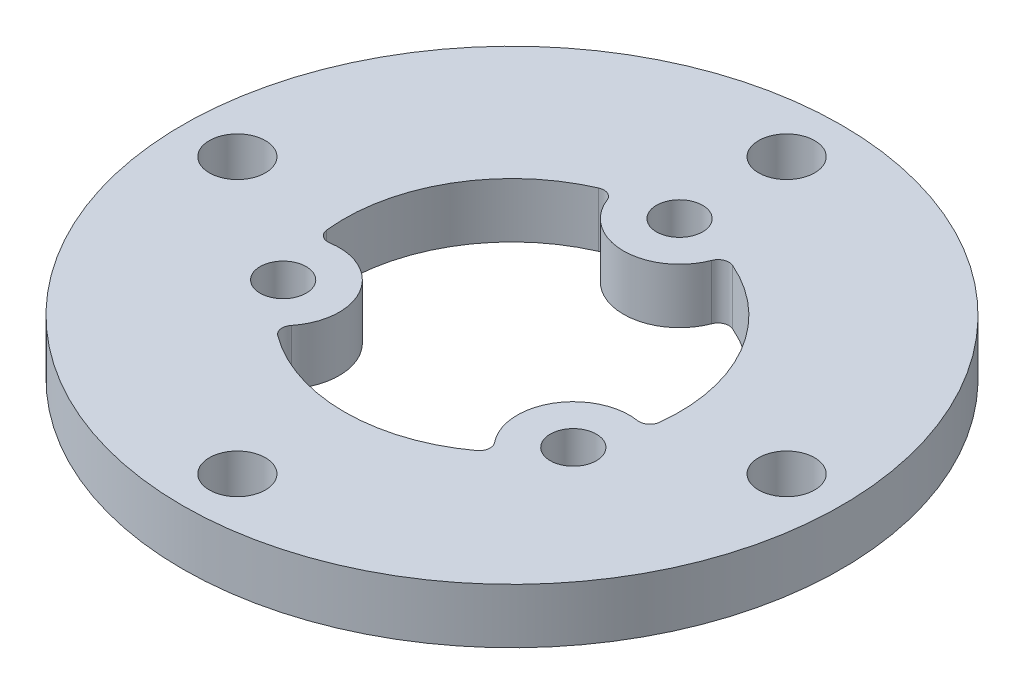
ISO-10303-21;
HEADER;
FILE_DESCRIPTION(('STEP AP214'),'2;1');
FILE_NAME('part.step','',(''),(''),'','','');
FILE_SCHEMA(('AUTOMOTIVE_DESIGN { 1 0 10303 214 1 1 1 1 }'));
ENDSEC;
DATA;
#1=APPLICATION_CONTEXT('core data for automotive mechanical design processes');
#2=APPLICATION_PROTOCOL_DEFINITION('international standard','automotive_design',2000,#1);
#3=PRODUCT_CONTEXT('',#1,'mechanical');
#4=PRODUCT('Part','Part','',(#3));
#5=PRODUCT_RELATED_PRODUCT_CATEGORY('part','',(#4));
#6=PRODUCT_DEFINITION_FORMATION('','',#4);
#7=PRODUCT_DEFINITION_CONTEXT('part definition',#1,'design');
#8=PRODUCT_DEFINITION('design','',#6,#7);
#9=PRODUCT_DEFINITION_SHAPE('','',#8);
#10=(LENGTH_UNIT() NAMED_UNIT(*) SI_UNIT(.MILLI.,.METRE.));
#11=(NAMED_UNIT(*) PLANE_ANGLE_UNIT() SI_UNIT($,.RADIAN.));
#12=(NAMED_UNIT(*) SI_UNIT($,.STERADIAN.) SOLID_ANGLE_UNIT());
#13=UNCERTAINTY_MEASURE_WITH_UNIT(LENGTH_MEASURE(1.E-05),#10,'distance_accuracy_value','');
#14=(GEOMETRIC_REPRESENTATION_CONTEXT(3) GLOBAL_UNCERTAINTY_ASSIGNED_CONTEXT((#13)) GLOBAL_UNIT_ASSIGNED_CONTEXT((#10,
#11,#12)) REPRESENTATION_CONTEXT('',''));
#15=CARTESIAN_POINT('',(0.,0.,0.));
#16=DIRECTION('',(0.,0.,1.));
#17=DIRECTION('',(1.,0.,0.));
#18=AXIS2_PLACEMENT_3D('',#15,#16,#17);
#19=CARTESIAN_POINT('',(0.,5.,0.));
#20=DIRECTION('',(0.,1.,0.));
#21=DIRECTION('',(0.,0.,1.));
#22=AXIS2_PLACEMENT_3D('',#19,#20,#21);
#23=PLANE('',#22);
#24=CARTESIAN_POINT('',(-25.,5.,0.));
#25=DIRECTION('',(0.,1.,0.));
#26=DIRECTION('',(0.,0.,1.));
#27=AXIS2_PLACEMENT_3D('',#24,#25,#26);
#28=CIRCLE('',#27,2.55);
#29=CARTESIAN_POINT('',(-25.,5.,2.55));
#30=VERTEX_POINT('',#29);
#31=EDGE_CURVE('E158',#30,#30,#28,.T.);
#32=ORIENTED_EDGE('',*,*,#31,.F.);
#33=EDGE_LOOP('',(#32));
#34=FACE_BOUND('',#33,.T.);
#35=CARTESIAN_POINT('',(25.,5.,0.));
#36=DIRECTION('',(0.,1.,0.));
#37=DIRECTION('',(0.,0.,1.));
#38=AXIS2_PLACEMENT_3D('',#35,#36,#37);
#39=CIRCLE('',#38,2.55);
#40=CARTESIAN_POINT('',(25.,5.,2.55));
#41=VERTEX_POINT('',#40);
#42=EDGE_CURVE('E172',#41,#41,#39,.T.);
#43=ORIENTED_EDGE('',*,*,#42,.F.);
#44=EDGE_LOOP('',(#43));
#45=FACE_BOUND('',#44,.T.);
#46=CARTESIAN_POINT('',(13.2068874077127,5.,7.625));
#47=DIRECTION('',(0.,1.,0.));
#48=DIRECTION('',(0.,0.,1.));
#49=AXIS2_PLACEMENT_3D('',#46,#47,#48);
#50=CIRCLE('',#49,2.1);
#51=CARTESIAN_POINT('',(13.2068874077127,5.,9.725));
#52=VERTEX_POINT('',#51);
#53=EDGE_CURVE('E184',#52,#52,#50,.T.);
#54=ORIENTED_EDGE('',*,*,#53,.F.);
#55=EDGE_LOOP('',(#54));
#56=FACE_BOUND('',#55,.T.);
#57=CARTESIAN_POINT('',(0.,5.,-15.25));
#58=DIRECTION('',(0.,1.,0.));
#59=DIRECTION('',(0.,0.,1.));
#60=AXIS2_PLACEMENT_3D('',#57,#58,#59);
#61=CIRCLE('',#60,2.1);
#62=CARTESIAN_POINT('',(0.,5.,-13.15));
#63=VERTEX_POINT('',#62);
#64=EDGE_CURVE('E196',#63,#63,#61,.T.);
#65=ORIENTED_EDGE('',*,*,#64,.F.);
#66=EDGE_LOOP('',(#65));
#67=FACE_BOUND('',#66,.T.);
#68=CARTESIAN_POINT('',(0.,5.,0.));
#69=DIRECTION('',(0.,1.,0.));
#70=DIRECTION('',(0.,0.,1.));
#71=AXIS2_PLACEMENT_3D('',#68,#69,#70);
#72=CIRCLE('',#71,30.);
#73=CARTESIAN_POINT('',(0.,5.,30.));
#74=VERTEX_POINT('',#73);
#75=EDGE_CURVE('E202',#74,#74,#72,.T.);
#76=ORIENTED_EDGE('',*,*,#75,.T.);
#77=EDGE_LOOP('',(#76));
#78=FACE_BOUND('',#77,.T.);
#79=CARTESIAN_POINT('',(0.,5.,-25.));
#80=DIRECTION('',(0.,1.,0.));
#81=DIRECTION('',(0.,0.,1.));
#82=AXIS2_PLACEMENT_3D('',#79,#80,#81);
#83=CIRCLE('',#82,2.55);
#84=CARTESIAN_POINT('',(0.,5.,-22.45));
#85=VERTEX_POINT('',#84);
#86=EDGE_CURVE('E190',#85,#85,#83,.T.);
#87=ORIENTED_EDGE('',*,*,#86,.F.);
#88=EDGE_LOOP('',(#87));
#89=FACE_BOUND('',#88,.T.);
#90=CARTESIAN_POINT('',(-13.2068874077127,5.,7.62500000000001));
#91=DIRECTION('',(0.,1.,0.));
#92=DIRECTION('',(0.,0.,1.));
#93=AXIS2_PLACEMENT_3D('',#90,#91,#92);
#94=CIRCLE('',#93,2.1);
#95=CARTESIAN_POINT('',(-13.2068874077127,5.,9.72500000000001));
#96=VERTEX_POINT('',#95);
#97=EDGE_CURVE('E178',#96,#96,#94,.T.);
#98=ORIENTED_EDGE('',*,*,#97,.F.);
#99=EDGE_LOOP('',(#98));
#100=FACE_BOUND('',#99,.T.);
#101=CARTESIAN_POINT('',(0.,5.,25.));
#102=DIRECTION('',(0.,1.,0.));
#103=DIRECTION('',(0.,0.,1.));
#104=AXIS2_PLACEMENT_3D('',#101,#102,#103);
#105=CIRCLE('',#104,2.55);
#106=CARTESIAN_POINT('',(0.,5.,27.55));
#107=VERTEX_POINT('',#106);
#108=EDGE_CURVE('E166',#107,#107,#105,.T.);
#109=ORIENTED_EDGE('',*,*,#108,.F.);
#110=EDGE_LOOP('',(#109));
#111=FACE_BOUND('',#110,.T.);
#112=CARTESIAN_POINT('',(0.,5.,0.));
#113=DIRECTION('',(0.,1.,0.));
#114=DIRECTION('',(0.,0.,1.));
#115=AXIS2_PLACEMENT_3D('',#112,#113,#114);
#116=CIRCLE('',#115,15.25);
#117=CARTESIAN_POINT('',(-6.09399831904025,5.,-13.9794736842105));
#118=VERTEX_POINT('',#117);
#119=CARTESIAN_POINT('',(-15.1535785015825,5.,1.71217948719675));
#120=VERTEX_POINT('',#119);
#121=EDGE_CURVE('E244',#118,#120,#116,.T.);
#122=ORIENTED_EDGE('',*,*,#121,.F.);
#123=CARTESIAN_POINT('',(-5.69439187189007,5.,-13.0627868852459));
#124=DIRECTION('',(0.,1.,0.));
#125=DIRECTION('',(0.,0.,1.));
#126=AXIS2_PLACEMENT_3D('',#123,#124,#125);
#127=CIRCLE('',#126,1.);
#128=CARTESIAN_POINT('',(-4.7608850076458,5.,-13.4213464122548));
#129=VERTEX_POINT('',#128);
#130=EDGE_CURVE('E41',#118,#129,#127,.F.);
#131=ORIENTED_EDGE('',*,*,#130,.T.);
#132=CARTESIAN_POINT('',(0.,5.,-15.25));
#133=DIRECTION('',(0.,-1.,0.));
#134=DIRECTION('',(0.,0.,1.));
#135=AXIS2_PLACEMENT_3D('',#132,#133,#134);
#136=CIRCLE('',#135,5.1);
#137=CARTESIAN_POINT('',(4.7608850076458,5.,-13.4213464122548));
#138=VERTEX_POINT('',#137);
#139=EDGE_CURVE('E149',#138,#129,#136,.T.);
#140=ORIENTED_EDGE('',*,*,#139,.F.);
#141=CARTESIAN_POINT('',(5.69439187189007,5.,-13.0627868852459));
#142=DIRECTION('',(0.,1.,0.));
#143=DIRECTION('',(0.,0.,1.));
#144=AXIS2_PLACEMENT_3D('',#141,#142,#143);
#145=CIRCLE('',#144,1.);
#146=CARTESIAN_POINT('',(6.09399831904025,5.,-13.9794736842105));
#147=VERTEX_POINT('',#146);
#148=EDGE_CURVE('E148',#138,#147,#145,.F.);
#149=ORIENTED_EDGE('',*,*,#148,.T.);
#150=CARTESIAN_POINT('',(0.,5.,0.));
#151=DIRECTION('',(0.,1.,0.));
#152=DIRECTION('',(0.,0.,1.));
#153=AXIS2_PLACEMENT_3D('',#150,#151,#152);
#154=CIRCLE('',#153,15.25);
#155=CARTESIAN_POINT('',(15.1535785015825,5.,1.71217948719674));
#156=VERTEX_POINT('',#155);
#157=EDGE_CURVE('E140',#156,#147,#154,.T.);
#158=ORIENTED_EDGE('',*,*,#157,.F.);
#159=CARTESIAN_POINT('',(14.1599012227902,5.,1.59990542246253));
#160=DIRECTION('',(0.,1.,0.));
#161=DIRECTION('',(0.,0.,1.));
#162=AXIS2_PLACEMENT_3D('',#159,#160,#161);
#163=CIRCLE('',#162,1.);
#164=CARTESIAN_POINT('',(14.0036694498267,5.,2.58762584500965));
#165=VERTEX_POINT('',#164);
#166=EDGE_CURVE('E123',#156,#165,#163,.F.);
#167=ORIENTED_EDGE('',*,*,#166,.T.);
#168=CARTESIAN_POINT('',(13.2068874077127,5.,7.625));
#169=DIRECTION('',(0.,-1.,0.));
#170=DIRECTION('',(0.,0.,1.));
#171=AXIS2_PLACEMENT_3D('',#168,#169,#170);
#172=CIRCLE('',#171,5.1);
#173=CARTESIAN_POINT('',(9.24278444218087,5.,10.8337205672451));
#174=VERTEX_POINT('',#173);
#175=EDGE_CURVE('E150',#174,#165,#172,.T.);
#176=ORIENTED_EDGE('',*,*,#175,.F.);
#177=CARTESIAN_POINT('',(8.46550935090012,5.,11.4628814627834));
#178=DIRECTION('',(0.,1.,0.));
#179=DIRECTION('',(0.,0.,1.));
#180=AXIS2_PLACEMENT_3D('',#177,#178,#179);
#181=CIRCLE('',#180,1.);
#182=CARTESIAN_POINT('',(9.05958018254224,5.,12.2672941970138));
#183=VERTEX_POINT('',#182);
#184=EDGE_CURVE('E230',#174,#183,#181,.F.);
#185=ORIENTED_EDGE('',*,*,#184,.T.);
#186=CARTESIAN_POINT('',(0.,5.,0.));
#187=DIRECTION('',(0.,1.,0.));
#188=DIRECTION('',(0.,0.,1.));
#189=AXIS2_PLACEMENT_3D('',#186,#187,#188);
#190=CIRCLE('',#189,15.25);
#191=CARTESIAN_POINT('',(-9.05958018254223,5.,12.2672941970138));
#192=VERTEX_POINT('',#191);
#193=EDGE_CURVE('E154',#192,#183,#190,.T.);
#194=ORIENTED_EDGE('',*,*,#193,.F.);
#195=CARTESIAN_POINT('',(-8.46550935090011,5.,11.4628814627834));
#196=DIRECTION('',(0.,1.,0.));
#197=DIRECTION('',(0.,0.,1.));
#198=AXIS2_PLACEMENT_3D('',#195,#196,#197);
#199=CIRCLE('',#198,1.);
#200=CARTESIAN_POINT('',(-9.24278444218086,5.,10.8337205672451));
#201=VERTEX_POINT('',#200);
#202=EDGE_CURVE('E234',#192,#201,#199,.F.);
#203=ORIENTED_EDGE('',*,*,#202,.T.);
#204=CARTESIAN_POINT('',(-13.2068874077127,5.,7.62500000000001));
#205=DIRECTION('',(0.,-1.,0.));
#206=DIRECTION('',(0.,0.,1.));
#207=AXIS2_PLACEMENT_3D('',#204,#205,#206);
#208=CIRCLE('',#207,5.1);
#209=CARTESIAN_POINT('',(-14.0036694498267,5.,2.58762584500966));
#210=VERTEX_POINT('',#209);
#211=EDGE_CURVE('E271',#210,#201,#208,.T.);
#212=ORIENTED_EDGE('',*,*,#211,.F.);
#213=CARTESIAN_POINT('',(-14.1599012227902,5.,1.59990542246254));
#214=DIRECTION('',(0.,1.,0.));
#215=DIRECTION('',(0.,0.,1.));
#216=AXIS2_PLACEMENT_3D('',#213,#214,#215);
#217=CIRCLE('',#216,1.);
#218=EDGE_CURVE('E238',#210,#120,#217,.F.);
#219=ORIENTED_EDGE('',*,*,#218,.T.);
#220=EDGE_LOOP('',(#122,#131,#140,#149,#158,#167,#176,#185,#194,#203,#212,#219));
#221=FACE_BOUND('',#220,.T.);
#222=ADVANCED_FACE('F33',(#34,#45,#56,#67,#78,#89,#100,#111,#221),#23,.T.);
#223=CARTESIAN_POINT('',(0.,0.,0.));
#224=DIRECTION('',(0.,1.,0.));
#225=DIRECTION('',(0.,0.,1.));
#226=AXIS2_PLACEMENT_3D('',#223,#224,#225);
#227=PLANE('',#226);
#228=CARTESIAN_POINT('',(-25.,0.,0.));
#229=DIRECTION('',(0.,1.,0.));
#230=DIRECTION('',(0.,0.,1.));
#231=AXIS2_PLACEMENT_3D('',#228,#229,#230);
#232=CIRCLE('',#231,2.55);
#233=CARTESIAN_POINT('',(-25.,0.,2.55));
#234=VERTEX_POINT('',#233);
#235=EDGE_CURVE('E162',#234,#234,#232,.T.);
#236=ORIENTED_EDGE('',*,*,#235,.T.);
#237=EDGE_LOOP('',(#236));
#238=FACE_BOUND('',#237,.T.);
#239=CARTESIAN_POINT('',(0.,0.,25.));
#240=DIRECTION('',(0.,1.,0.));
#241=DIRECTION('',(0.,0.,1.));
#242=AXIS2_PLACEMENT_3D('',#239,#240,#241);
#243=CIRCLE('',#242,2.55);
#244=CARTESIAN_POINT('',(0.,0.,27.55));
#245=VERTEX_POINT('',#244);
#246=EDGE_CURVE('E161',#245,#245,#243,.T.);
#247=ORIENTED_EDGE('',*,*,#246,.T.);
#248=EDGE_LOOP('',(#247));
#249=FACE_BOUND('',#248,.T.);
#250=CARTESIAN_POINT('',(25.,0.,0.));
#251=DIRECTION('',(0.,1.,0.));
#252=DIRECTION('',(0.,0.,1.));
#253=AXIS2_PLACEMENT_3D('',#250,#251,#252);
#254=CIRCLE('',#253,2.55);
#255=CARTESIAN_POINT('',(25.,0.,2.55));
#256=VERTEX_POINT('',#255);
#257=EDGE_CURVE('E169',#256,#256,#254,.T.);
#258=ORIENTED_EDGE('',*,*,#257,.T.);
#259=EDGE_LOOP('',(#258));
#260=FACE_BOUND('',#259,.T.);
#261=CARTESIAN_POINT('',(-13.2068874077127,0.,7.62500000000001));
#262=DIRECTION('',(0.,1.,0.));
#263=DIRECTION('',(0.,0.,1.));
#264=AXIS2_PLACEMENT_3D('',#261,#262,#263);
#265=CIRCLE('',#264,2.1);
#266=CARTESIAN_POINT('',(-13.2068874077127,0.,9.72500000000001));
#267=VERTEX_POINT('',#266);
#268=EDGE_CURVE('E175',#267,#267,#265,.T.);
#269=ORIENTED_EDGE('',*,*,#268,.T.);
#270=EDGE_LOOP('',(#269));
#271=FACE_BOUND('',#270,.T.);
#272=CARTESIAN_POINT('',(13.2068874077127,0.,7.625));
#273=DIRECTION('',(0.,1.,0.));
#274=DIRECTION('',(0.,0.,1.));
#275=AXIS2_PLACEMENT_3D('',#272,#273,#274);
#276=CIRCLE('',#275,2.1);
#277=CARTESIAN_POINT('',(13.2068874077127,0.,9.725));
#278=VERTEX_POINT('',#277);
#279=EDGE_CURVE('E181',#278,#278,#276,.T.);
#280=ORIENTED_EDGE('',*,*,#279,.T.);
#281=EDGE_LOOP('',(#280));
#282=FACE_BOUND('',#281,.T.);
#283=CARTESIAN_POINT('',(0.,0.,-25.));
#284=DIRECTION('',(0.,1.,0.));
#285=DIRECTION('',(0.,0.,1.));
#286=AXIS2_PLACEMENT_3D('',#283,#284,#285);
#287=CIRCLE('',#286,2.55);
#288=CARTESIAN_POINT('',(0.,0.,-22.45));
#289=VERTEX_POINT('',#288);
#290=EDGE_CURVE('E187',#289,#289,#287,.T.);
#291=ORIENTED_EDGE('',*,*,#290,.T.);
#292=EDGE_LOOP('',(#291));
#293=FACE_BOUND('',#292,.T.);
#294=CARTESIAN_POINT('',(0.,0.,-15.25));
#295=DIRECTION('',(0.,1.,0.));
#296=DIRECTION('',(0.,0.,1.));
#297=AXIS2_PLACEMENT_3D('',#294,#295,#296);
#298=CIRCLE('',#297,2.1);
#299=CARTESIAN_POINT('',(0.,0.,-13.15));
#300=VERTEX_POINT('',#299);
#301=EDGE_CURVE('E193',#300,#300,#298,.T.);
#302=ORIENTED_EDGE('',*,*,#301,.T.);
#303=EDGE_LOOP('',(#302));
#304=FACE_BOUND('',#303,.T.);
#305=CARTESIAN_POINT('',(0.,0.,0.));
#306=DIRECTION('',(0.,1.,0.));
#307=DIRECTION('',(0.,0.,1.));
#308=AXIS2_PLACEMENT_3D('',#305,#306,#307);
#309=CIRCLE('',#308,30.);
#310=CARTESIAN_POINT('',(0.,0.,30.));
#311=VERTEX_POINT('',#310);
#312=EDGE_CURVE('E199',#311,#311,#309,.T.);
#313=ORIENTED_EDGE('',*,*,#312,.F.);
#314=EDGE_LOOP('',(#313));
#315=FACE_BOUND('',#314,.T.);
#316=CARTESIAN_POINT('',(0.,0.,0.));
#317=DIRECTION('',(0.,1.,0.));
#318=DIRECTION('',(0.,0.,1.));
#319=AXIS2_PLACEMENT_3D('',#316,#317,#318);
#320=CIRCLE('',#319,15.25);
#321=CARTESIAN_POINT('',(15.1535785015825,0.,1.71217948719674));
#322=VERTEX_POINT('',#321);
#323=CARTESIAN_POINT('',(6.09399831904025,0.,-13.9794736842105));
#324=VERTEX_POINT('',#323);
#325=EDGE_CURVE('E142',#322,#324,#320,.T.);
#326=ORIENTED_EDGE('',*,*,#325,.T.);
#327=CARTESIAN_POINT('',(5.69439187189007,0.,-13.0627868852459));
#328=DIRECTION('',(0.,1.,0.));
#329=DIRECTION('',(0.,0.,1.));
#330=AXIS2_PLACEMENT_3D('',#327,#328,#329);
#331=CIRCLE('',#330,1.);
#332=CARTESIAN_POINT('',(4.7608850076458,0.,-13.4213464122548));
#333=VERTEX_POINT('',#332);
#334=EDGE_CURVE('E55',#324,#333,#331,.T.);
#335=ORIENTED_EDGE('',*,*,#334,.T.);
#336=CARTESIAN_POINT('',(0.,0.,-15.25));
#337=DIRECTION('',(0.,-1.,0.));
#338=DIRECTION('',(0.,0.,1.));
#339=AXIS2_PLACEMENT_3D('',#336,#337,#338);
#340=CIRCLE('',#339,5.1);
#341=CARTESIAN_POINT('',(-4.7608850076458,0.,-13.4213464122548));
#342=VERTEX_POINT('',#341);
#343=EDGE_CURVE('E165',#333,#342,#340,.T.);
#344=ORIENTED_EDGE('',*,*,#343,.T.);
#345=CARTESIAN_POINT('',(-5.69439187189007,0.,-13.0627868852459));
#346=DIRECTION('',(0.,1.,0.));
#347=DIRECTION('',(0.,0.,1.));
#348=AXIS2_PLACEMENT_3D('',#345,#346,#347);
#349=CIRCLE('',#348,1.);
#350=CARTESIAN_POINT('',(-6.09399831904025,0.,-13.9794736842105));
#351=VERTEX_POINT('',#350);
#352=EDGE_CURVE('E11',#342,#351,#349,.T.);
#353=ORIENTED_EDGE('',*,*,#352,.T.);
#354=CARTESIAN_POINT('',(0.,0.,0.));
#355=DIRECTION('',(0.,1.,0.));
#356=DIRECTION('',(0.,0.,1.));
#357=AXIS2_PLACEMENT_3D('',#354,#355,#356);
#358=CIRCLE('',#357,15.25);
#359=CARTESIAN_POINT('',(-15.1535785015825,0.,1.71217948719675));
#360=VERTEX_POINT('',#359);
#361=EDGE_CURVE('E152',#351,#360,#358,.T.);
#362=ORIENTED_EDGE('',*,*,#361,.T.);
#363=CARTESIAN_POINT('',(-14.1599012227902,0.,1.59990542246254));
#364=DIRECTION('',(0.,1.,0.));
#365=DIRECTION('',(0.,0.,1.));
#366=AXIS2_PLACEMENT_3D('',#363,#364,#365);
#367=CIRCLE('',#366,1.);
#368=CARTESIAN_POINT('',(-14.0036694498267,0.,2.58762584500966));
#369=VERTEX_POINT('',#368);
#370=EDGE_CURVE('E240',#360,#369,#367,.T.);
#371=ORIENTED_EDGE('',*,*,#370,.T.);
#372=CARTESIAN_POINT('',(-13.2068874077127,0.,7.62500000000001));
#373=DIRECTION('',(0.,-1.,0.));
#374=DIRECTION('',(0.,0.,1.));
#375=AXIS2_PLACEMENT_3D('',#372,#373,#374);
#376=CIRCLE('',#375,5.1);
#377=CARTESIAN_POINT('',(-9.24278444218086,0.,10.8337205672451));
#378=VERTEX_POINT('',#377);
#379=EDGE_CURVE('E257',#369,#378,#376,.T.);
#380=ORIENTED_EDGE('',*,*,#379,.T.);
#381=CARTESIAN_POINT('',(-8.46550935090011,0.,11.4628814627834));
#382=DIRECTION('',(0.,1.,0.));
#383=DIRECTION('',(0.,0.,1.));
#384=AXIS2_PLACEMENT_3D('',#381,#382,#383);
#385=CIRCLE('',#384,1.);
#386=CARTESIAN_POINT('',(-9.05958018254223,0.,12.2672941970138));
#387=VERTEX_POINT('',#386);
#388=EDGE_CURVE('E236',#378,#387,#385,.T.);
#389=ORIENTED_EDGE('',*,*,#388,.T.);
#390=CARTESIAN_POINT('',(0.,0.,0.));
#391=DIRECTION('',(0.,1.,0.));
#392=DIRECTION('',(0.,0.,1.));
#393=AXIS2_PLACEMENT_3D('',#390,#391,#392);
#394=CIRCLE('',#393,15.25);
#395=CARTESIAN_POINT('',(9.05958018254224,0.,12.2672941970138));
#396=VERTEX_POINT('',#395);
#397=EDGE_CURVE('E260',#387,#396,#394,.T.);
#398=ORIENTED_EDGE('',*,*,#397,.T.);
#399=CARTESIAN_POINT('',(8.46550935090012,0.,11.4628814627834));
#400=DIRECTION('',(0.,1.,0.));
#401=DIRECTION('',(0.,0.,1.));
#402=AXIS2_PLACEMENT_3D('',#399,#400,#401);
#403=CIRCLE('',#402,1.);
#404=CARTESIAN_POINT('',(9.24278444218087,0.,10.8337205672451));
#405=VERTEX_POINT('',#404);
#406=EDGE_CURVE('E232',#396,#405,#403,.T.);
#407=ORIENTED_EDGE('',*,*,#406,.T.);
#408=CARTESIAN_POINT('',(13.2068874077127,0.,7.625));
#409=DIRECTION('',(0.,-1.,0.));
#410=DIRECTION('',(0.,0.,1.));
#411=AXIS2_PLACEMENT_3D('',#408,#409,#410);
#412=CIRCLE('',#411,5.1);
#413=CARTESIAN_POINT('',(14.0036694498267,0.,2.58762584500965));
#414=VERTEX_POINT('',#413);
#415=EDGE_CURVE('E265',#405,#414,#412,.T.);
#416=ORIENTED_EDGE('',*,*,#415,.T.);
#417=CARTESIAN_POINT('',(14.1599012227902,0.,1.59990542246253));
#418=DIRECTION('',(0.,1.,0.));
#419=DIRECTION('',(0.,0.,1.));
#420=AXIS2_PLACEMENT_3D('',#417,#418,#419);
#421=CIRCLE('',#420,1.);
#422=EDGE_CURVE('E133',#414,#322,#421,.T.);
#423=ORIENTED_EDGE('',*,*,#422,.T.);
#424=EDGE_LOOP('',(#326,#335,#344,#353,#362,#371,#380,#389,#398,#407,#416,#423));
#425=FACE_BOUND('',#424,.T.);
#426=ADVANCED_FACE('F252',(#238,#249,#260,#271,#282,#293,#304,#315,#425),#227,.F.);
#427=CARTESIAN_POINT('',(0.,5.,0.));
#428=DIRECTION('',(0.,-1.,0.));
#429=DIRECTION('',(0.,0.,-1.));
#430=AXIS2_PLACEMENT_3D('',#427,#428,#429);
#431=CYLINDRICAL_SURFACE('',#430,30.);
#432=ORIENTED_EDGE('',*,*,#75,.F.);
#433=EDGE_LOOP('',(#432));
#434=FACE_BOUND('',#433,.T.);
#435=ORIENTED_EDGE('',*,*,#312,.T.);
#436=EDGE_LOOP('',(#435));
#437=FACE_BOUND('',#436,.T.);
#438=ADVANCED_FACE('F303',(#434,#437),#431,.T.);
#439=CARTESIAN_POINT('',(0.,5.,-15.25));
#440=DIRECTION('',(0.,-1.,0.));
#441=DIRECTION('',(0.,0.,-1.));
#442=AXIS2_PLACEMENT_3D('',#439,#440,#441);
#443=CYLINDRICAL_SURFACE('',#442,2.1);
#444=ORIENTED_EDGE('',*,*,#64,.T.);
#445=EDGE_LOOP('',(#444));
#446=FACE_BOUND('',#445,.T.);
#447=ORIENTED_EDGE('',*,*,#301,.F.);
#448=EDGE_LOOP('',(#447));
#449=FACE_BOUND('',#448,.T.);
#450=ADVANCED_FACE('F309',(#446,#449),#443,.F.);
#451=CARTESIAN_POINT('',(0.,5.,-25.));
#452=DIRECTION('',(0.,-1.,0.));
#453=DIRECTION('',(0.,0.,-1.));
#454=AXIS2_PLACEMENT_3D('',#451,#452,#453);
#455=CYLINDRICAL_SURFACE('',#454,2.55);
#456=ORIENTED_EDGE('',*,*,#86,.T.);
#457=EDGE_LOOP('',(#456));
#458=FACE_BOUND('',#457,.T.);
#459=ORIENTED_EDGE('',*,*,#290,.F.);
#460=EDGE_LOOP('',(#459));
#461=FACE_BOUND('',#460,.T.);
#462=ADVANCED_FACE('F450',(#458,#461),#455,.F.);
#463=CARTESIAN_POINT('',(13.2068874077127,5.,7.625));
#464=DIRECTION('',(0.,-1.,0.));
#465=DIRECTION('',(0.,0.,-1.));
#466=AXIS2_PLACEMENT_3D('',#463,#464,#465);
#467=CYLINDRICAL_SURFACE('',#466,2.1);
#468=ORIENTED_EDGE('',*,*,#53,.T.);
#469=EDGE_LOOP('',(#468));
#470=FACE_BOUND('',#469,.T.);
#471=ORIENTED_EDGE('',*,*,#279,.F.);
#472=EDGE_LOOP('',(#471));
#473=FACE_BOUND('',#472,.T.);
#474=ADVANCED_FACE('F442',(#470,#473),#467,.F.);
#475=CARTESIAN_POINT('',(-13.2068874077127,5.,7.62500000000001));
#476=DIRECTION('',(0.,-1.,0.));
#477=DIRECTION('',(0.,0.,-1.));
#478=AXIS2_PLACEMENT_3D('',#475,#476,#477);
#479=CYLINDRICAL_SURFACE('',#478,2.1);
#480=ORIENTED_EDGE('',*,*,#97,.T.);
#481=EDGE_LOOP('',(#480));
#482=FACE_BOUND('',#481,.T.);
#483=ORIENTED_EDGE('',*,*,#268,.F.);
#484=EDGE_LOOP('',(#483));
#485=FACE_BOUND('',#484,.T.);
#486=ADVANCED_FACE('F434',(#482,#485),#479,.F.);
#487=CARTESIAN_POINT('',(25.,5.,0.));
#488=DIRECTION('',(0.,-1.,0.));
#489=DIRECTION('',(0.,0.,-1.));
#490=AXIS2_PLACEMENT_3D('',#487,#488,#489);
#491=CYLINDRICAL_SURFACE('',#490,2.55);
#492=ORIENTED_EDGE('',*,*,#42,.T.);
#493=EDGE_LOOP('',(#492));
#494=FACE_BOUND('',#493,.T.);
#495=ORIENTED_EDGE('',*,*,#257,.F.);
#496=EDGE_LOOP('',(#495));
#497=FACE_BOUND('',#496,.T.);
#498=ADVANCED_FACE('F426',(#494,#497),#491,.F.);
#499=CARTESIAN_POINT('',(0.,5.,25.));
#500=DIRECTION('',(0.,-1.,0.));
#501=DIRECTION('',(0.,0.,-1.));
#502=AXIS2_PLACEMENT_3D('',#499,#500,#501);
#503=CYLINDRICAL_SURFACE('',#502,2.55);
#504=ORIENTED_EDGE('',*,*,#108,.T.);
#505=EDGE_LOOP('',(#504));
#506=FACE_BOUND('',#505,.T.);
#507=ORIENTED_EDGE('',*,*,#246,.F.);
#508=EDGE_LOOP('',(#507));
#509=FACE_BOUND('',#508,.T.);
#510=ADVANCED_FACE('F419',(#506,#509),#503,.F.);
#511=CARTESIAN_POINT('',(-25.,5.,0.));
#512=DIRECTION('',(0.,-1.,0.));
#513=DIRECTION('',(0.,0.,-1.));
#514=AXIS2_PLACEMENT_3D('',#511,#512,#513);
#515=CYLINDRICAL_SURFACE('',#514,2.55);
#516=ORIENTED_EDGE('',*,*,#31,.T.);
#517=EDGE_LOOP('',(#516));
#518=FACE_BOUND('',#517,.T.);
#519=ORIENTED_EDGE('',*,*,#235,.F.);
#520=EDGE_LOOP('',(#519));
#521=FACE_BOUND('',#520,.T.);
#522=ADVANCED_FACE('F402',(#518,#521),#515,.F.);
#523=CARTESIAN_POINT('',(0.,0.,0.));
#524=DIRECTION('',(0.,1.,0.));
#525=DIRECTION('',(0.,0.,1.));
#526=AXIS2_PLACEMENT_3D('',#523,#524,#525);
#527=CYLINDRICAL_SURFACE('',#526,15.25);
#528=ORIENTED_EDGE('',*,*,#121,.T.);
#529=DIRECTION('',(0.,1.,0.));
#530=VECTOR('',#529,1.);
#531=CARTESIAN_POINT('',(-15.1535785015825,0.,1.71217948719675));
#532=LINE('',#531,#530);
#533=EDGE_CURVE('E224',#120,#360,#532,.F.);
#534=ORIENTED_EDGE('',*,*,#533,.T.);
#535=ORIENTED_EDGE('',*,*,#361,.F.);
#536=DIRECTION('',(0.,1.,0.));
#537=VECTOR('',#536,1.);
#538=CARTESIAN_POINT('',(-6.09399831904025,0.,-13.9794736842105));
#539=LINE('',#538,#537);
#540=EDGE_CURVE('E221',#351,#118,#539,.T.);
#541=ORIENTED_EDGE('',*,*,#540,.T.);
#542=EDGE_LOOP('',(#528,#534,#535,#541));
#543=FACE_BOUND('',#542,.T.);
#544=ADVANCED_FACE('F255',(#543),#527,.F.);
#545=CARTESIAN_POINT('',(0.,0.,-15.25));
#546=DIRECTION('',(0.,1.,0.));
#547=DIRECTION('',(0.,0.,1.));
#548=AXIS2_PLACEMENT_3D('',#545,#546,#547);
#549=CYLINDRICAL_SURFACE('',#548,5.1);
#550=ORIENTED_EDGE('',*,*,#343,.F.);
#551=DIRECTION('',(0.,1.,0.));
#552=VECTOR('',#551,1.);
#553=CARTESIAN_POINT('',(4.7608850076458,0.,-13.4213464122548));
#554=LINE('',#553,#552);
#555=EDGE_CURVE('E134',#333,#138,#554,.T.);
#556=ORIENTED_EDGE('',*,*,#555,.T.);
#557=ORIENTED_EDGE('',*,*,#139,.T.);
#558=DIRECTION('',(0.,1.,0.));
#559=VECTOR('',#558,1.);
#560=CARTESIAN_POINT('',(-4.7608850076458,0.,-13.4213464122548));
#561=LINE('',#560,#559);
#562=EDGE_CURVE('E48',#129,#342,#561,.F.);
#563=ORIENTED_EDGE('',*,*,#562,.T.);
#564=EDGE_LOOP('',(#550,#556,#557,#563));
#565=FACE_BOUND('',#564,.T.);
#566=ADVANCED_FACE('F247',(#565),#549,.T.);
#567=CARTESIAN_POINT('',(0.,0.,0.));
#568=DIRECTION('',(0.,1.,0.));
#569=DIRECTION('',(0.,0.,1.));
#570=AXIS2_PLACEMENT_3D('',#567,#568,#569);
#571=CYLINDRICAL_SURFACE('',#570,15.25);
#572=ORIENTED_EDGE('',*,*,#325,.F.);
#573=DIRECTION('',(0.,1.,0.));
#574=VECTOR('',#573,1.);
#575=CARTESIAN_POINT('',(15.1535785015825,0.,1.71217948719674));
#576=LINE('',#575,#574);
#577=EDGE_CURVE('E127',#322,#156,#576,.T.);
#578=ORIENTED_EDGE('',*,*,#577,.T.);
#579=ORIENTED_EDGE('',*,*,#157,.T.);
#580=DIRECTION('',(0.,1.,0.));
#581=VECTOR('',#580,1.);
#582=CARTESIAN_POINT('',(6.09399831904025,0.,-13.9794736842105));
#583=LINE('',#582,#581);
#584=EDGE_CURVE('E144',#147,#324,#583,.F.);
#585=ORIENTED_EDGE('',*,*,#584,.T.);
#586=EDGE_LOOP('',(#572,#578,#579,#585));
#587=FACE_BOUND('',#586,.T.);
#588=ADVANCED_FACE('F139',(#587),#571,.F.);
#589=CARTESIAN_POINT('',(13.2068874077127,0.,7.625));
#590=DIRECTION('',(0.,1.,0.));
#591=DIRECTION('',(0.,0.,1.));
#592=AXIS2_PLACEMENT_3D('',#589,#590,#591);
#593=CYLINDRICAL_SURFACE('',#592,5.1);
#594=ORIENTED_EDGE('',*,*,#175,.T.);
#595=DIRECTION('',(0.,1.,0.));
#596=VECTOR('',#595,1.);
#597=CARTESIAN_POINT('',(14.0036694498267,0.,2.58762584500965));
#598=LINE('',#597,#596);
#599=EDGE_CURVE('E128',#165,#414,#598,.F.);
#600=ORIENTED_EDGE('',*,*,#599,.T.);
#601=ORIENTED_EDGE('',*,*,#415,.F.);
#602=DIRECTION('',(0.,1.,0.));
#603=VECTOR('',#602,1.);
#604=CARTESIAN_POINT('',(9.24278444218087,0.,10.8337205672451));
#605=LINE('',#604,#603);
#606=EDGE_CURVE('E143',#405,#174,#605,.T.);
#607=ORIENTED_EDGE('',*,*,#606,.T.);
#608=EDGE_LOOP('',(#594,#600,#601,#607));
#609=FACE_BOUND('',#608,.T.);
#610=ADVANCED_FACE('F286',(#609),#593,.T.);
#611=CARTESIAN_POINT('',(0.,0.,0.));
#612=DIRECTION('',(0.,1.,0.));
#613=DIRECTION('',(0.,0.,1.));
#614=AXIS2_PLACEMENT_3D('',#611,#612,#613);
#615=CYLINDRICAL_SURFACE('',#614,15.25);
#616=ORIENTED_EDGE('',*,*,#193,.T.);
#617=DIRECTION('',(0.,1.,0.));
#618=VECTOR('',#617,1.);
#619=CARTESIAN_POINT('',(9.05958018254224,0.,12.2672941970138));
#620=LINE('',#619,#618);
#621=EDGE_CURVE('E214',#183,#396,#620,.F.);
#622=ORIENTED_EDGE('',*,*,#621,.T.);
#623=ORIENTED_EDGE('',*,*,#397,.F.);
#624=DIRECTION('',(0.,1.,0.));
#625=VECTOR('',#624,1.);
#626=CARTESIAN_POINT('',(-9.05958018254223,0.,12.2672941970138));
#627=LINE('',#626,#625);
#628=EDGE_CURVE('E211',#387,#192,#627,.T.);
#629=ORIENTED_EDGE('',*,*,#628,.T.);
#630=EDGE_LOOP('',(#616,#622,#623,#629));
#631=FACE_BOUND('',#630,.T.);
#632=ADVANCED_FACE('F277',(#631),#615,.F.);
#633=CARTESIAN_POINT('',(-13.2068874077127,0.,7.62500000000001));
#634=DIRECTION('',(0.,1.,0.));
#635=DIRECTION('',(0.,0.,1.));
#636=AXIS2_PLACEMENT_3D('',#633,#634,#635);
#637=CYLINDRICAL_SURFACE('',#636,5.1);
#638=ORIENTED_EDGE('',*,*,#211,.T.);
#639=DIRECTION('',(0.,1.,0.));
#640=VECTOR('',#639,1.);
#641=CARTESIAN_POINT('',(-9.24278444218086,0.,10.8337205672451));
#642=LINE('',#641,#640);
#643=EDGE_CURVE('E219',#201,#378,#642,.F.);
#644=ORIENTED_EDGE('',*,*,#643,.T.);
#645=ORIENTED_EDGE('',*,*,#379,.F.);
#646=DIRECTION('',(0.,1.,0.));
#647=VECTOR('',#646,1.);
#648=CARTESIAN_POINT('',(-14.0036694498267,0.,2.58762584500966));
#649=LINE('',#648,#647);
#650=EDGE_CURVE('E216',#369,#210,#649,.T.);
#651=ORIENTED_EDGE('',*,*,#650,.T.);
#652=EDGE_LOOP('',(#638,#644,#645,#651));
#653=FACE_BOUND('',#652,.T.);
#654=ADVANCED_FACE('F293',(#653),#637,.T.);
#655=CARTESIAN_POINT('',(14.1599012227902,0.,1.59990542246253));
#656=DIRECTION('',(0.,1.,0.));
#657=DIRECTION('',(0.,0.,1.));
#658=AXIS2_PLACEMENT_3D('',#655,#656,#657);
#659=CYLINDRICAL_SURFACE('',#658,1.);
#660=ORIENTED_EDGE('',*,*,#422,.F.);
#661=ORIENTED_EDGE('',*,*,#599,.F.);
#662=ORIENTED_EDGE('',*,*,#166,.F.);
#663=ORIENTED_EDGE('',*,*,#577,.F.);
#664=EDGE_LOOP('',(#660,#661,#662,#663));
#665=FACE_BOUND('',#664,.T.);
#666=ADVANCED_FACE('F126',(#665),#659,.F.);
#667=CARTESIAN_POINT('',(8.46550935090012,0.,11.4628814627834));
#668=DIRECTION('',(0.,1.,0.));
#669=DIRECTION('',(0.,0.,1.));
#670=AXIS2_PLACEMENT_3D('',#667,#668,#669);
#671=CYLINDRICAL_SURFACE('',#670,1.);
#672=ORIENTED_EDGE('',*,*,#406,.F.);
#673=ORIENTED_EDGE('',*,*,#621,.F.);
#674=ORIENTED_EDGE('',*,*,#184,.F.);
#675=ORIENTED_EDGE('',*,*,#606,.F.);
#676=EDGE_LOOP('',(#672,#673,#674,#675));
#677=FACE_BOUND('',#676,.T.);
#678=ADVANCED_FACE('F282',(#677),#671,.F.);
#679=CARTESIAN_POINT('',(-8.46550935090011,0.,11.4628814627834));
#680=DIRECTION('',(0.,1.,0.));
#681=DIRECTION('',(0.,0.,1.));
#682=AXIS2_PLACEMENT_3D('',#679,#680,#681);
#683=CYLINDRICAL_SURFACE('',#682,1.);
#684=ORIENTED_EDGE('',*,*,#388,.F.);
#685=ORIENTED_EDGE('',*,*,#643,.F.);
#686=ORIENTED_EDGE('',*,*,#202,.F.);
#687=ORIENTED_EDGE('',*,*,#628,.F.);
#688=EDGE_LOOP('',(#684,#685,#686,#687));
#689=FACE_BOUND('',#688,.T.);
#690=ADVANCED_FACE('F319',(#689),#683,.F.);
#691=CARTESIAN_POINT('',(-14.1599012227902,0.,1.59990542246254));
#692=DIRECTION('',(0.,1.,0.));
#693=DIRECTION('',(0.,0.,1.));
#694=AXIS2_PLACEMENT_3D('',#691,#692,#693);
#695=CYLINDRICAL_SURFACE('',#694,1.);
#696=ORIENTED_EDGE('',*,*,#370,.F.);
#697=ORIENTED_EDGE('',*,*,#533,.F.);
#698=ORIENTED_EDGE('',*,*,#218,.F.);
#699=ORIENTED_EDGE('',*,*,#650,.F.);
#700=EDGE_LOOP('',(#696,#697,#698,#699));
#701=FACE_BOUND('',#700,.T.);
#702=ADVANCED_FACE('F322',(#701),#695,.F.);
#703=CARTESIAN_POINT('',(5.69439187189007,0.,-13.0627868852459));
#704=DIRECTION('',(0.,1.,0.));
#705=DIRECTION('',(0.,0.,1.));
#706=AXIS2_PLACEMENT_3D('',#703,#704,#705);
#707=CYLINDRICAL_SURFACE('',#706,1.);
#708=ORIENTED_EDGE('',*,*,#334,.F.);
#709=ORIENTED_EDGE('',*,*,#584,.F.);
#710=ORIENTED_EDGE('',*,*,#148,.F.);
#711=ORIENTED_EDGE('',*,*,#555,.F.);
#712=EDGE_LOOP('',(#708,#709,#710,#711));
#713=FACE_BOUND('',#712,.T.);
#714=ADVANCED_FACE('F325',(#713),#707,.F.);
#715=CARTESIAN_POINT('',(-5.69439187189007,0.,-13.0627868852459));
#716=DIRECTION('',(0.,1.,0.));
#717=DIRECTION('',(0.,0.,1.));
#718=AXIS2_PLACEMENT_3D('',#715,#716,#717);
#719=CYLINDRICAL_SURFACE('',#718,1.);
#720=ORIENTED_EDGE('',*,*,#352,.F.);
#721=ORIENTED_EDGE('',*,*,#562,.F.);
#722=ORIENTED_EDGE('',*,*,#130,.F.);
#723=ORIENTED_EDGE('',*,*,#540,.F.);
#724=EDGE_LOOP('',(#720,#721,#722,#723));
#725=FACE_BOUND('',#724,.T.);
#726=ADVANCED_FACE('F35',(#725),#719,.F.);
#727=CLOSED_SHELL('',(#222,#426,#438,#450,#462,#474,#486,#498,#510,#522,#544,#566,#588,#610,
#632,#654,#666,#678,#690,#702,#714,#726));
#728=MANIFOLD_SOLID_BREP('B2',#727);
#729=ADVANCED_BREP_SHAPE_REPRESENTATION('',(#18,#728),#14);
#730=SHAPE_DEFINITION_REPRESENTATION(#9,#729);
ENDSEC;
END-ISO-10303-21;
